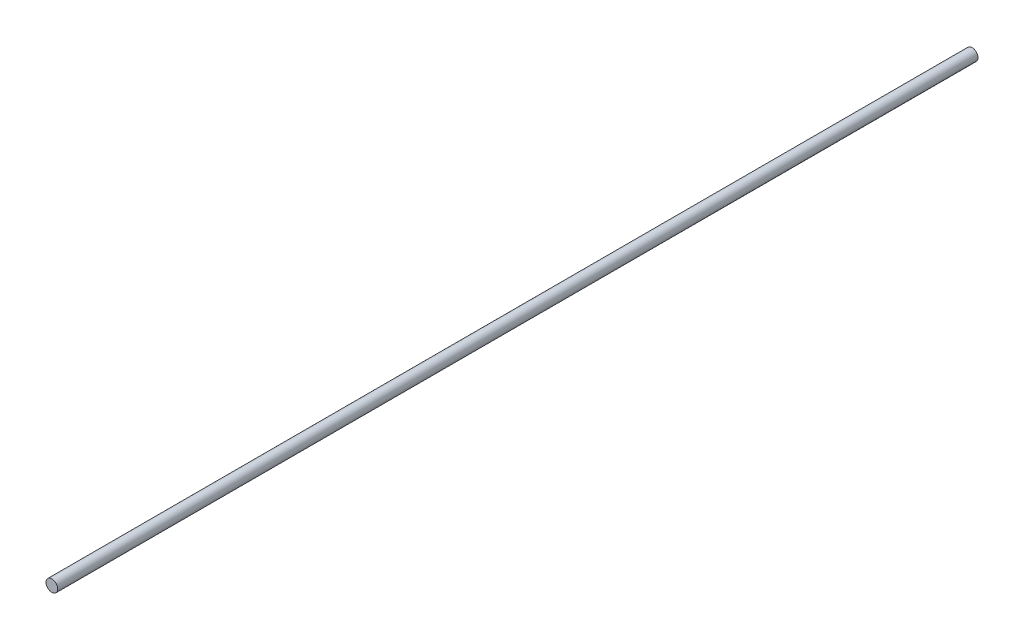
ISO-10303-21;
HEADER;
FILE_DESCRIPTION(('STEP AP214'),'2;1');
FILE_NAME('part.step','',(''),(''),'','','');
FILE_SCHEMA(('AUTOMOTIVE_DESIGN { 1 0 10303 214 1 1 1 1 }'));
ENDSEC;
DATA;
#1=APPLICATION_CONTEXT('core data for automotive mechanical design processes');
#2=APPLICATION_PROTOCOL_DEFINITION('international standard','automotive_design',2000,#1);
#3=PRODUCT_CONTEXT('',#1,'mechanical');
#4=PRODUCT('Part','Part','',(#3));
#5=PRODUCT_RELATED_PRODUCT_CATEGORY('part','',(#4));
#6=PRODUCT_DEFINITION_FORMATION('','',#4);
#7=PRODUCT_DEFINITION_CONTEXT('part definition',#1,'design');
#8=PRODUCT_DEFINITION('design','',#6,#7);
#9=PRODUCT_DEFINITION_SHAPE('','',#8);
#10=(LENGTH_UNIT() NAMED_UNIT(*) SI_UNIT(.MILLI.,.METRE.));
#11=(NAMED_UNIT(*) PLANE_ANGLE_UNIT() SI_UNIT($,.RADIAN.));
#12=(NAMED_UNIT(*) SI_UNIT($,.STERADIAN.) SOLID_ANGLE_UNIT());
#13=UNCERTAINTY_MEASURE_WITH_UNIT(LENGTH_MEASURE(1.E-05),#10,'distance_accuracy_value','');
#14=(GEOMETRIC_REPRESENTATION_CONTEXT(3) GLOBAL_UNCERTAINTY_ASSIGNED_CONTEXT((#13)) GLOBAL_UNIT_ASSIGNED_CONTEXT((#10,
#11,#12)) REPRESENTATION_CONTEXT('',''));
#15=CARTESIAN_POINT('',(0.,0.,0.));
#16=DIRECTION('',(0.,0.,1.));
#17=DIRECTION('',(1.,0.,0.));
#18=AXIS2_PLACEMENT_3D('',#15,#16,#17);
#19=CARTESIAN_POINT('',(0.,0.,628.));
#20=DIRECTION('',(0.,0.,-1.));
#21=DIRECTION('',(-1.,0.,0.));
#22=AXIS2_PLACEMENT_3D('',#19,#20,#21);
#23=CYLINDRICAL_SURFACE('',#22,4.);
#24=CARTESIAN_POINT('',(0.,0.,628.));
#25=DIRECTION('',(0.,0.,1.));
#26=DIRECTION('',(1.,0.,0.));
#27=AXIS2_PLACEMENT_3D('',#24,#25,#26);
#28=CIRCLE('',#27,4.);
#29=CARTESIAN_POINT('',(4.,0.,628.));
#30=VERTEX_POINT('',#29);
#31=EDGE_CURVE('E10',#30,#30,#28,.T.);
#32=ORIENTED_EDGE('',*,*,#31,.F.);
#33=EDGE_LOOP('',(#32));
#34=FACE_BOUND('',#33,.T.);
#35=CARTESIAN_POINT('',(0.,0.,0.));
#36=DIRECTION('',(0.,0.,1.));
#37=DIRECTION('',(1.,0.,0.));
#38=AXIS2_PLACEMENT_3D('',#35,#36,#37);
#39=CIRCLE('',#38,4.);
#40=CARTESIAN_POINT('',(4.,0.,0.));
#41=VERTEX_POINT('',#40);
#42=EDGE_CURVE('E34',#41,#41,#39,.T.);
#43=ORIENTED_EDGE('',*,*,#42,.T.);
#44=EDGE_LOOP('',(#43));
#45=FACE_BOUND('',#44,.T.);
#46=ADVANCED_FACE('F31',(#34,#45),#23,.T.);
#47=CARTESIAN_POINT('',(0.,0.,628.));
#48=DIRECTION('',(0.,0.,1.));
#49=DIRECTION('',(1.,0.,0.));
#50=AXIS2_PLACEMENT_3D('',#47,#48,#49);
#51=PLANE('',#50);
#52=ORIENTED_EDGE('',*,*,#31,.T.);
#53=EDGE_LOOP('',(#52));
#54=FACE_BOUND('',#53,.T.);
#55=ADVANCED_FACE('F46',(#54),#51,.T.);
#56=CARTESIAN_POINT('',(0.,0.,0.));
#57=DIRECTION('',(0.,0.,1.));
#58=DIRECTION('',(1.,0.,0.));
#59=AXIS2_PLACEMENT_3D('',#56,#57,#58);
#60=PLANE('',#59);
#61=ORIENTED_EDGE('',*,*,#42,.F.);
#62=EDGE_LOOP('',(#61));
#63=FACE_BOUND('',#62,.T.);
#64=ADVANCED_FACE('F44',(#63),#60,.F.);
#65=CLOSED_SHELL('',(#46,#55,#64));
#66=MANIFOLD_SOLID_BREP('B2',#65);
#67=ADVANCED_BREP_SHAPE_REPRESENTATION('',(#18,#66),#14);
#68=SHAPE_DEFINITION_REPRESENTATION(#9,#67);
ENDSEC;
END-ISO-10303-21;
